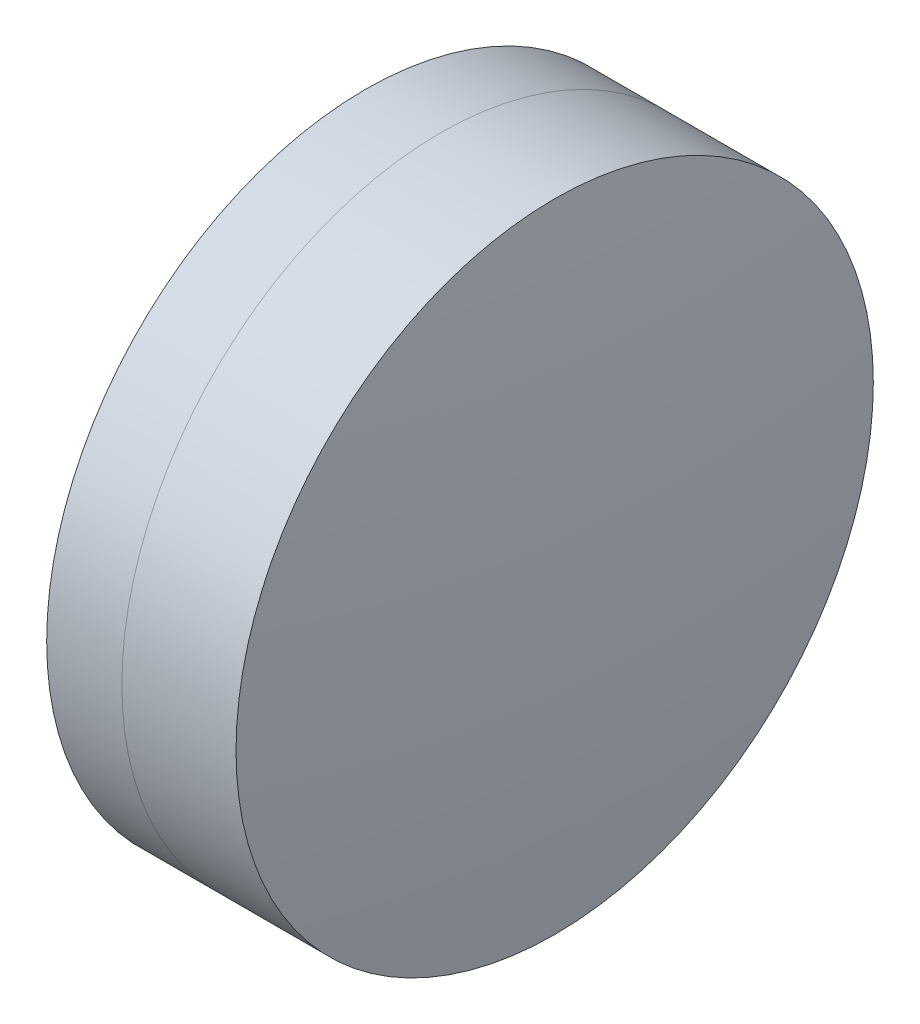
ISO-10303-21;
HEADER;
FILE_DESCRIPTION(('STEP AP214'),'2;1');
FILE_NAME('part.step','',(''),(''),'','','');
FILE_SCHEMA(('AUTOMOTIVE_DESIGN { 1 0 10303 214 1 1 1 1 }'));
ENDSEC;
DATA;
#1=APPLICATION_CONTEXT('core data for automotive mechanical design processes');
#2=APPLICATION_PROTOCOL_DEFINITION('international standard','automotive_design',2000,#1);
#3=PRODUCT_CONTEXT('',#1,'mechanical');
#4=PRODUCT('Part','Part','',(#3));
#5=PRODUCT_RELATED_PRODUCT_CATEGORY('part','',(#4));
#6=PRODUCT_DEFINITION_FORMATION('','',#4);
#7=PRODUCT_DEFINITION_CONTEXT('part definition',#1,'design');
#8=PRODUCT_DEFINITION('design','',#6,#7);
#9=PRODUCT_DEFINITION_SHAPE('','',#8);
#10=(LENGTH_UNIT() NAMED_UNIT(*) SI_UNIT(.MILLI.,.METRE.));
#11=(NAMED_UNIT(*) PLANE_ANGLE_UNIT() SI_UNIT($,.RADIAN.));
#12=(NAMED_UNIT(*) SI_UNIT($,.STERADIAN.) SOLID_ANGLE_UNIT());
#13=UNCERTAINTY_MEASURE_WITH_UNIT(LENGTH_MEASURE(1.E-05),#10,'distance_accuracy_value','');
#14=(GEOMETRIC_REPRESENTATION_CONTEXT(3) GLOBAL_UNCERTAINTY_ASSIGNED_CONTEXT((#13)) GLOBAL_UNIT_ASSIGNED_CONTEXT((#10,
#11,#12)) REPRESENTATION_CONTEXT('',''));
#15=CARTESIAN_POINT('',(0.,0.,0.));
#16=DIRECTION('',(0.,0.,1.));
#17=DIRECTION('',(1.,0.,0.));
#18=AXIS2_PLACEMENT_3D('',#15,#16,#17);
#19=CARTESIAN_POINT('',(211.095845808419,0.,0.));
#20=DIRECTION('',(-1.,0.,0.));
#21=DIRECTION('',(0.,0.,1.));
#22=AXIS2_PLACEMENT_3D('',#19,#20,#21);
#23=SPHERICAL_SURFACE('',#22,35.5);
#24=CARTESIAN_POINT('',(244.246411414454,0.,0.));
#25=DIRECTION('',(-1.,0.,0.));
#26=DIRECTION('',(0.,0.,1.));
#27=AXIS2_PLACEMENT_3D('',#24,#25,#26);
#28=CIRCLE('',#27,12.7);
#29=CARTESIAN_POINT('',(244.246411414454,0.,12.7));
#30=VERTEX_POINT('',#29);
#31=EDGE_CURVE('E11',#30,#30,#28,.T.);
#32=ORIENTED_EDGE('',*,*,#31,.T.);
#33=EDGE_LOOP('',(#32));
#34=FACE_BOUND('',#33,.T.);
#35=ADVANCED_FACE('F45',(#34),#23,.F.);
#36=CARTESIAN_POINT('',(-0.551919992657797,0.,0.));
#37=DIRECTION('',(-1.,0.,0.));
#38=DIRECTION('',(0.,0.,1.));
#39=AXIS2_PLACEMENT_3D('',#36,#37,#38);
#40=CYLINDRICAL_SURFACE('',#39,12.7);
#41=CARTESIAN_POINT('',(248.79579600761,0.,0.));
#42=DIRECTION('',(-1.,0.,0.));
#43=DIRECTION('',(0.,0.,1.));
#44=AXIS2_PLACEMENT_3D('',#41,#42,#43);
#45=CIRCLE('',#44,12.7);
#46=CARTESIAN_POINT('',(248.79579600761,0.,12.7));
#47=VERTEX_POINT('',#46);
#48=EDGE_CURVE('E51',#47,#47,#45,.T.);
#49=ORIENTED_EDGE('',*,*,#48,.T.);
#50=EDGE_LOOP('',(#49));
#51=FACE_BOUND('',#50,.T.);
#52=ORIENTED_EDGE('',*,*,#31,.F.);
#53=EDGE_LOOP('',(#52));
#54=FACE_BOUND('',#53,.T.);
#55=ADVANCED_FACE('F57',(#51,#54),#40,.T.);
#56=CARTESIAN_POINT('',(148.395845808419,0.,0.));
#57=DIRECTION('',(-1.,0.,0.));
#58=DIRECTION('',(0.,0.,1.));
#59=AXIS2_PLACEMENT_3D('',#56,#57,#58);
#60=SPHERICAL_SURFACE('',#59,101.2);
#61=ORIENTED_EDGE('',*,*,#48,.F.);
#62=EDGE_LOOP('',(#61));
#63=FACE_BOUND('',#62,.T.);
#64=ADVANCED_FACE('F60',(#63),#60,.T.);
#65=CLOSED_SHELL('',(#35,#55,#64));
#66=MANIFOLD_SOLID_BREP('B2',#65);
#67=CARTESIAN_POINT('',(289.195845808419,0.,0.));
#68=DIRECTION('',(-1.,0.,0.));
#69=DIRECTION('',(0.,0.,1.));
#70=AXIS2_PLACEMENT_3D('',#67,#68,#69);
#71=SPHERICAL_SURFACE('',#70,49.6);
#72=CARTESIAN_POINT('',(241.249313087064,0.,0.));
#73=DIRECTION('',(-1.,0.,0.));
#74=DIRECTION('',(0.,0.,1.));
#75=AXIS2_PLACEMENT_3D('',#72,#73,#74);
#76=CIRCLE('',#75,12.7);
#77=CARTESIAN_POINT('',(241.249313087064,0.,12.7));
#78=VERTEX_POINT('',#77);
#79=EDGE_CURVE('E44',#78,#78,#76,.T.);
#80=ORIENTED_EDGE('',*,*,#79,.T.);
#81=EDGE_LOOP('',(#80));
#82=FACE_BOUND('',#81,.T.);
#83=ADVANCED_FACE('F86',(#82),#71,.T.);
#84=CARTESIAN_POINT('',(161.833171692834,0.,0.));
#85=DIRECTION('',(-1.,0.,0.));
#86=DIRECTION('',(0.,0.,1.));
#87=AXIS2_PLACEMENT_3D('',#84,#85,#86);
#88=CYLINDRICAL_SURFACE('',#87,12.7);
#89=CARTESIAN_POINT('',(244.246411414454,0.,0.));
#90=DIRECTION('',(-1.,0.,0.));
#91=DIRECTION('',(0.,0.,1.));
#92=AXIS2_PLACEMENT_3D('',#89,#90,#91);
#93=CIRCLE('',#92,12.7);
#94=CARTESIAN_POINT('',(244.246411414454,0.,12.7));
#95=VERTEX_POINT('',#94);
#96=EDGE_CURVE('E92',#95,#95,#93,.T.);
#97=ORIENTED_EDGE('',*,*,#96,.T.);
#98=EDGE_LOOP('',(#97));
#99=FACE_BOUND('',#98,.T.);
#100=ORIENTED_EDGE('',*,*,#79,.F.);
#101=EDGE_LOOP('',(#100));
#102=FACE_BOUND('',#101,.T.);
#103=ADVANCED_FACE('F98',(#99,#102),#88,.T.);
#104=CARTESIAN_POINT('',(211.095845808419,0.,0.));
#105=DIRECTION('',(-1.,0.,0.));
#106=DIRECTION('',(0.,0.,1.));
#107=AXIS2_PLACEMENT_3D('',#104,#105,#106);
#108=SPHERICAL_SURFACE('',#107,35.5);
#109=ORIENTED_EDGE('',*,*,#96,.F.);
#110=EDGE_LOOP('',(#109));
#111=FACE_BOUND('',#110,.T.);
#112=ADVANCED_FACE('F101',(#111),#108,.T.);
#113=CLOSED_SHELL('',(#83,#103,#112));
#114=MANIFOLD_SOLID_BREP('B6',#113);
#115=ADVANCED_BREP_SHAPE_REPRESENTATION('',(#18,#66,#114),#14);
#116=SHAPE_DEFINITION_REPRESENTATION(#9,#115);
ENDSEC;
END-ISO-10303-21;
